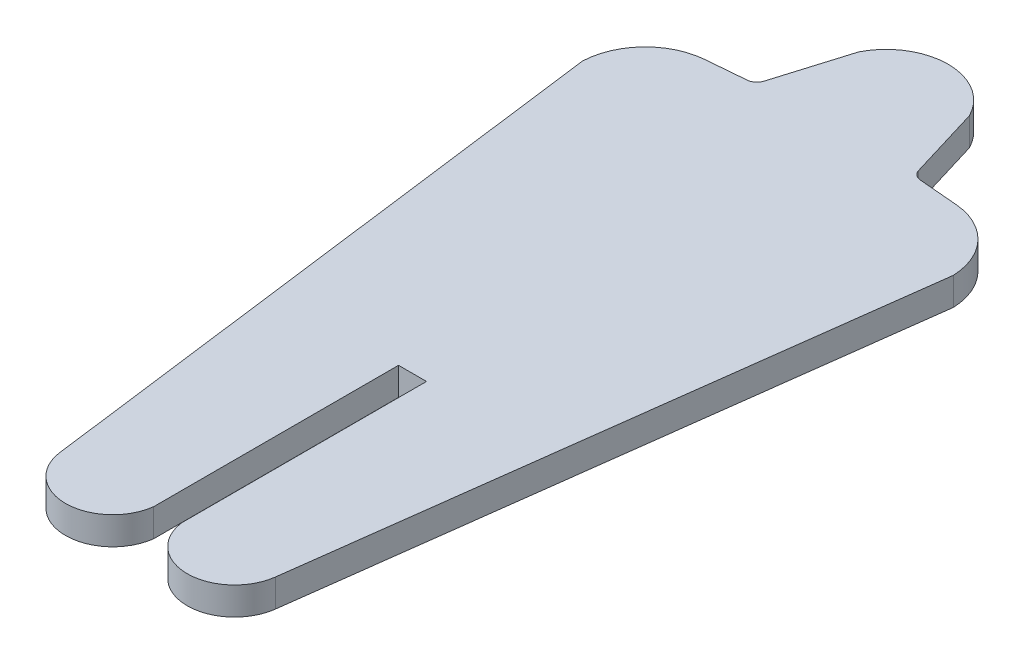
ISO-10303-21;
HEADER;
FILE_DESCRIPTION(('STEP AP214'),'2;1');
FILE_NAME('part.step','',(''),(''),'','','');
FILE_SCHEMA(('AUTOMOTIVE_DESIGN { 1 0 10303 214 1 1 1 1 }'));
ENDSEC;
DATA;
#1=APPLICATION_CONTEXT('core data for automotive mechanical design processes');
#2=APPLICATION_PROTOCOL_DEFINITION('international standard','automotive_design',2000,#1);
#3=PRODUCT_CONTEXT('',#1,'mechanical');
#4=PRODUCT('Part','Part','',(#3));
#5=PRODUCT_RELATED_PRODUCT_CATEGORY('part','',(#4));
#6=PRODUCT_DEFINITION_FORMATION('','',#4);
#7=PRODUCT_DEFINITION_CONTEXT('part definition',#1,'design');
#8=PRODUCT_DEFINITION('design','',#6,#7);
#9=PRODUCT_DEFINITION_SHAPE('','',#8);
#10=(LENGTH_UNIT() NAMED_UNIT(*) SI_UNIT(.MILLI.,.METRE.));
#11=(NAMED_UNIT(*) PLANE_ANGLE_UNIT() SI_UNIT($,.RADIAN.));
#12=(NAMED_UNIT(*) SI_UNIT($,.STERADIAN.) SOLID_ANGLE_UNIT());
#13=UNCERTAINTY_MEASURE_WITH_UNIT(LENGTH_MEASURE(1.E-05),#10,'distance_accuracy_value','');
#14=(GEOMETRIC_REPRESENTATION_CONTEXT(3) GLOBAL_UNCERTAINTY_ASSIGNED_CONTEXT((#13)) GLOBAL_UNIT_ASSIGNED_CONTEXT((#10,
#11,#12)) REPRESENTATION_CONTEXT('',''));
#15=CARTESIAN_POINT('',(0.,0.,0.));
#16=DIRECTION('',(0.,0.,1.));
#17=DIRECTION('',(1.,0.,0.));
#18=AXIS2_PLACEMENT_3D('',#15,#16,#17);
#19=CARTESIAN_POINT('',(136.033446322855,1.45,-243.035338057565));
#20=DIRECTION('',(-0.991724155452253,0.,-0.12838691324475));
#21=DIRECTION('',(-0.12838691324475,0.,0.991724155452253));
#22=AXIS2_PLACEMENT_3D('',#19,#20,#21);
#23=PLANE('',#22);
#24=DIRECTION('',(0.12838691324475,0.,-0.991724155452253));
#25=VECTOR('',#24,1.);
#26=CARTESIAN_POINT('',(136.033446322855,0.,-243.035338057565));
#27=LINE('',#26,#25);
#28=CARTESIAN_POINT('',(146.479849626352,0.,-323.728535143188));
#29=VERTEX_POINT('',#28);
#30=CARTESIAN_POINT('',(150.53009574584,0.,-355.01464375588));
#31=VERTEX_POINT('',#30);
#32=EDGE_CURVE('E180',#29,#31,#27,.T.);
#33=ORIENTED_EDGE('',*,*,#32,.T.);
#34=DIRECTION('',(0.,-1.,0.));
#35=VECTOR('',#34,1.);
#36=CARTESIAN_POINT('',(150.53009574584,1.45,-355.01464375588));
#37=LINE('',#36,#35);
#38=CARTESIAN_POINT('',(150.53009574584,1.45,-355.01464375588));
#39=VERTEX_POINT('',#38);
#40=EDGE_CURVE('E11',#39,#31,#37,.T.);
#41=ORIENTED_EDGE('',*,*,#40,.F.);
#42=DIRECTION('',(0.12838691324475,0.,-0.991724155452253));
#43=VECTOR('',#42,1.);
#44=CARTESIAN_POINT('',(136.033446322855,1.45,-243.035338057565));
#45=LINE('',#44,#43);
#46=CARTESIAN_POINT('',(146.479849626352,1.45,-323.728535143188));
#47=VERTEX_POINT('',#46);
#48=EDGE_CURVE('E219',#47,#39,#45,.T.);
#49=ORIENTED_EDGE('',*,*,#48,.F.);
#50=DIRECTION('',(0.,-1.,0.));
#51=VECTOR('',#50,1.);
#52=CARTESIAN_POINT('',(146.479849626352,1.45,-323.728535143188));
#53=LINE('',#52,#51);
#54=EDGE_CURVE('E176',#47,#29,#53,.T.);
#55=ORIENTED_EDGE('',*,*,#54,.T.);
#56=EDGE_LOOP('',(#33,#41,#49,#55));
#57=FACE_BOUND('',#56,.T.);
#58=ADVANCED_FACE('F37',(#57),#23,.F.);
#59=CARTESIAN_POINT('',(147.130452567162,1.45,-354.887927370378));
#60=DIRECTION('',(0.,-1.,0.));
#61=DIRECTION('',(0.,0.,-1.));
#62=AXIS2_PLACEMENT_3D('',#59,#60,#61);
#63=CYLINDRICAL_SURFACE('',#62,3.40200393660632);
#64=CARTESIAN_POINT('',(147.130452567162,0.,-354.887927370378));
#65=DIRECTION('',(0.,1.,0.));
#66=DIRECTION('',(0.,0.,1.));
#67=AXIS2_PLACEMENT_3D('',#64,#65,#66);
#68=CIRCLE('',#67,3.40200393660632);
#69=CARTESIAN_POINT('',(147.420197469524,0.,-358.277570224166));
#70=VERTEX_POINT('',#69);
#71=EDGE_CURVE('E183',#31,#70,#68,.T.);
#72=ORIENTED_EDGE('',*,*,#71,.T.);
#73=DIRECTION('',(0.,-1.,0.));
#74=VECTOR('',#73,1.);
#75=CARTESIAN_POINT('',(147.420197469524,1.45,-358.277570224166));
#76=LINE('',#75,#74);
#77=CARTESIAN_POINT('',(147.420197469524,1.45,-358.277570224166));
#78=VERTEX_POINT('',#77);
#79=EDGE_CURVE('E45',#78,#70,#76,.T.);
#80=ORIENTED_EDGE('',*,*,#79,.F.);
#81=CARTESIAN_POINT('',(147.130452567162,1.45,-354.887927370378));
#82=DIRECTION('',(0.,1.,0.));
#83=DIRECTION('',(0.,0.,1.));
#84=AXIS2_PLACEMENT_3D('',#81,#82,#83);
#85=CIRCLE('',#84,3.40200393660632);
#86=EDGE_CURVE('E116',#39,#78,#85,.T.);
#87=ORIENTED_EDGE('',*,*,#86,.F.);
#88=ORIENTED_EDGE('',*,*,#40,.T.);
#89=EDGE_LOOP('',(#72,#80,#87,#88));
#90=FACE_BOUND('',#89,.T.);
#91=ADVANCED_FACE('F251',(#90),#63,.T.);
#92=CARTESIAN_POINT('',(-39.1867338386929,1.45,-374.228633751436));
#93=DIRECTION('',(0.085168893166534,0.,-0.996366528761774));
#94=DIRECTION('',(-0.996366528761774,0.,-0.0851688931665341));
#95=AXIS2_PLACEMENT_3D('',#92,#93,#94);
#96=PLANE('',#95);
#97=DIRECTION('',(0.996366528761774,0.,0.0851688931665341));
#98=VECTOR('',#97,1.);
#99=CARTESIAN_POINT('',(-39.1867338386929,0.,-374.228633751436));
#100=LINE('',#99,#98);
#101=CARTESIAN_POINT('',(145.375119536964,0.,-358.452382423219));
#102=VERTEX_POINT('',#101);
#103=EDGE_CURVE('E186',#102,#70,#100,.T.);
#104=ORIENTED_EDGE('',*,*,#103,.F.);
#105=DIRECTION('',(0.,-1.,0.));
#106=VECTOR('',#105,1.);
#107=CARTESIAN_POINT('',(145.375119536964,1.45,-358.452382423219));
#108=LINE('',#107,#106);
#109=CARTESIAN_POINT('',(145.375119536964,1.45,-358.452382423219));
#110=VERTEX_POINT('',#109);
#111=EDGE_CURVE('E244',#110,#102,#108,.T.);
#112=ORIENTED_EDGE('',*,*,#111,.F.);
#113=DIRECTION('',(0.996366528761774,0.,0.0851688931665341));
#114=VECTOR('',#113,1.);
#115=CARTESIAN_POINT('',(-39.1867338386929,1.45,-374.228633751436));
#116=LINE('',#115,#114);
#117=EDGE_CURVE('E250',#110,#78,#116,.T.);
#118=ORIENTED_EDGE('',*,*,#117,.T.);
#119=ORIENTED_EDGE('',*,*,#79,.T.);
#120=EDGE_LOOP('',(#104,#112,#118,#119));
#121=FACE_BOUND('',#120,.T.);
#122=ADVANCED_FACE('F248',(#121),#96,.T.);
#123=CARTESIAN_POINT('',(145.422306578861,1.45,-359.004409972416));
#124=DIRECTION('',(0.,-1.,0.));
#125=DIRECTION('',(0.,0.,-1.));
#126=AXIS2_PLACEMENT_3D('',#123,#124,#125);
#127=CYLINDRICAL_SURFACE('',#126,0.554040641104413);
#128=CARTESIAN_POINT('',(145.422306578861,0.,-359.004409972416));
#129=DIRECTION('',(0.,1.,0.));
#130=DIRECTION('',(0.,0.,1.));
#131=AXIS2_PLACEMENT_3D('',#128,#129,#130);
#132=CIRCLE('',#131,0.554040641104413);
#133=CARTESIAN_POINT('',(144.8920428308,0.,-358.84384413082));
#134=VERTEX_POINT('',#133);
#135=EDGE_CURVE('E189',#134,#102,#132,.T.);
#136=ORIENTED_EDGE('',*,*,#135,.F.);
#137=DIRECTION('',(0.,-1.,0.));
#138=VECTOR('',#137,1.);
#139=CARTESIAN_POINT('',(144.8920428308,1.45,-358.84384413082));
#140=LINE('',#139,#138);
#141=CARTESIAN_POINT('',(144.8920428308,1.45,-358.84384413082));
#142=VERTEX_POINT('',#141);
#143=EDGE_CURVE('E242',#142,#134,#140,.T.);
#144=ORIENTED_EDGE('',*,*,#143,.F.);
#145=CARTESIAN_POINT('',(145.422306578861,1.45,-359.004409972416));
#146=DIRECTION('',(0.,1.,0.));
#147=DIRECTION('',(0.,0.,1.));
#148=AXIS2_PLACEMENT_3D('',#145,#146,#147);
#149=CIRCLE('',#148,0.554040641104413);
#150=EDGE_CURVE('E263',#142,#110,#149,.T.);
#151=ORIENTED_EDGE('',*,*,#150,.T.);
#152=ORIENTED_EDGE('',*,*,#111,.T.);
#153=EDGE_LOOP('',(#136,#144,#151,#152));
#154=FACE_BOUND('',#153,.T.);
#155=ADVANCED_FACE('F260',(#154),#127,.F.);
#156=CARTESIAN_POINT('',(154.161676438201,1.45,-328.23116962254));
#157=DIRECTION('',(0.957084555439553,0.,-0.289808822741948));
#158=DIRECTION('',(-0.289808822741948,0.,-0.957084555439553));
#159=AXIS2_PLACEMENT_3D('',#156,#157,#158);
#160=PLANE('',#159);
#161=DIRECTION('',(0.289808822741948,0.,0.957084555439553));
#162=VECTOR('',#161,1.);
#163=CARTESIAN_POINT('',(154.161676438201,0.,-328.23116962254));
#164=LINE('',#163,#162);
#165=CARTESIAN_POINT('',(143.74421014501,0.,-362.634525606298));
#166=VERTEX_POINT('',#165);
#167=EDGE_CURVE('E192',#166,#134,#164,.T.);
#168=ORIENTED_EDGE('',*,*,#167,.F.);
#169=DIRECTION('',(0.,-1.,0.));
#170=VECTOR('',#169,1.);
#171=CARTESIAN_POINT('',(143.74421014501,1.45,-362.634525606298));
#172=LINE('',#171,#170);
#173=CARTESIAN_POINT('',(143.74421014501,1.45,-362.634525606298));
#174=VERTEX_POINT('',#173);
#175=EDGE_CURVE('E240',#174,#166,#172,.T.);
#176=ORIENTED_EDGE('',*,*,#175,.F.);
#177=DIRECTION('',(0.289808822741948,0.,0.957084555439553));
#178=VECTOR('',#177,1.);
#179=CARTESIAN_POINT('',(154.161676438201,1.45,-328.23116962254));
#180=LINE('',#179,#178);
#181=EDGE_CURVE('E267',#174,#142,#180,.T.);
#182=ORIENTED_EDGE('',*,*,#181,.T.);
#183=ORIENTED_EDGE('',*,*,#143,.T.);
#184=EDGE_LOOP('',(#168,#176,#182,#183));
#185=FACE_BOUND('',#184,.T.);
#186=ADVANCED_FACE('F322',(#185),#160,.T.);
#187=CARTESIAN_POINT('',(140.86229529581,1.45,-361.17850699736));
#188=DIRECTION('',(0.,-1.,0.));
#189=DIRECTION('',(0.,0.,-1.));
#190=AXIS2_PLACEMENT_3D('',#187,#188,#189);
#191=CYLINDRICAL_SURFACE('',#190,3.22884242223351);
#192=CARTESIAN_POINT('',(140.86229529581,0.,-361.17850699736));
#193=DIRECTION('',(0.,1.,0.));
#194=DIRECTION('',(0.,0.,1.));
#195=AXIS2_PLACEMENT_3D('',#192,#193,#194);
#196=CIRCLE('',#195,3.22884242223351);
#197=CARTESIAN_POINT('',(137.980380294136,0.,-362.634525304504));
#198=VERTEX_POINT('',#197);
#199=EDGE_CURVE('E195',#166,#198,#196,.T.);
#200=ORIENTED_EDGE('',*,*,#199,.T.);
#201=DIRECTION('',(0.,-1.,0.));
#202=VECTOR('',#201,1.);
#203=CARTESIAN_POINT('',(137.980380294136,1.45,-362.634525304504));
#204=LINE('',#203,#202);
#205=CARTESIAN_POINT('',(137.980380294136,1.45,-362.634525304504));
#206=VERTEX_POINT('',#205);
#207=EDGE_CURVE('E238',#206,#198,#204,.T.);
#208=ORIENTED_EDGE('',*,*,#207,.F.);
#209=CARTESIAN_POINT('',(140.86229529581,1.45,-361.17850699736));
#210=DIRECTION('',(0.,1.,0.));
#211=DIRECTION('',(0.,0.,1.));
#212=AXIS2_PLACEMENT_3D('',#209,#210,#211);
#213=CIRCLE('',#212,3.22884242223351);
#214=EDGE_CURVE('E273',#174,#206,#213,.T.);
#215=ORIENTED_EDGE('',*,*,#214,.F.);
#216=ORIENTED_EDGE('',*,*,#175,.T.);
#217=EDGE_LOOP('',(#200,#208,#215,#216));
#218=FACE_BOUND('',#217,.T.);
#219=ADVANCED_FACE('F325',(#218),#191,.T.);
#220=CARTESIAN_POINT('',(95.7775692530297,1.45,-223.261091696266));
#221=DIRECTION('',(-0.957084539661645,0.,-0.289808874847989));
#222=DIRECTION('',(-0.289808874847989,0.,0.957084539661645));
#223=AXIS2_PLACEMENT_3D('',#220,#221,#222);
#224=PLANE('',#223);
#225=DIRECTION('',(0.289808874847989,0.,-0.957084539661645));
#226=VECTOR('',#225,1.);
#227=CARTESIAN_POINT('',(95.7775692530297,0.,-223.261091696266));
#228=LINE('',#227,#226);
#229=CARTESIAN_POINT('',(136.83254745993,0.,-358.843844082921));
#230=VERTEX_POINT('',#229);
#231=EDGE_CURVE('E198',#230,#198,#228,.T.);
#232=ORIENTED_EDGE('',*,*,#231,.F.);
#233=DIRECTION('',(0.,-1.,0.));
#234=VECTOR('',#233,1.);
#235=CARTESIAN_POINT('',(136.83254745993,1.45,-358.843844082921));
#236=LINE('',#235,#234);
#237=CARTESIAN_POINT('',(136.83254745993,1.45,-358.843844082921));
#238=VERTEX_POINT('',#237);
#239=EDGE_CURVE('E236',#238,#230,#236,.T.);
#240=ORIENTED_EDGE('',*,*,#239,.F.);
#241=DIRECTION('',(0.289808874847989,0.,-0.957084539661645));
#242=VECTOR('',#241,1.);
#243=CARTESIAN_POINT('',(95.7775692530297,1.45,-223.261091696266));
#244=LINE('',#243,#242);
#245=EDGE_CURVE('E275',#238,#206,#244,.T.);
#246=ORIENTED_EDGE('',*,*,#245,.T.);
#247=ORIENTED_EDGE('',*,*,#207,.T.);
#248=EDGE_LOOP('',(#232,#240,#246,#247));
#249=FACE_BOUND('',#248,.T.);
#250=ADVANCED_FACE('F329',(#249),#224,.T.);
#251=CARTESIAN_POINT('',(136.302283701965,1.45,-359.00440989181));
#252=DIRECTION('',(0.,-1.,0.));
#253=DIRECTION('',(0.,0.,-1.));
#254=AXIS2_PLACEMENT_3D('',#251,#252,#253);
#255=CYLINDRICAL_SURFACE('',#254,0.554040641104498);
#256=CARTESIAN_POINT('',(136.302283701965,0.,-359.00440989181));
#257=DIRECTION('',(0.,1.,0.));
#258=DIRECTION('',(0.,0.,1.));
#259=AXIS2_PLACEMENT_3D('',#256,#257,#258);
#260=CIRCLE('',#259,0.554040641104498);
#261=CARTESIAN_POINT('',(136.34947073482,0.,-358.45238234184));
#262=VERTEX_POINT('',#261);
#263=EDGE_CURVE('E201',#262,#230,#260,.T.);
#264=ORIENTED_EDGE('',*,*,#263,.F.);
#265=DIRECTION('',(0.,-1.,0.));
#266=VECTOR('',#265,1.);
#267=CARTESIAN_POINT('',(136.34947073482,1.45,-358.45238234184));
#268=LINE('',#267,#266);
#269=CARTESIAN_POINT('',(136.34947073482,1.45,-358.45238234184));
#270=VERTEX_POINT('',#269);
#271=EDGE_CURVE('E234',#270,#262,#268,.T.);
#272=ORIENTED_EDGE('',*,*,#271,.F.);
#273=CARTESIAN_POINT('',(136.302283701965,1.45,-359.00440989181));
#274=DIRECTION('',(0.,1.,0.));
#275=DIRECTION('',(0.,0.,1.));
#276=AXIS2_PLACEMENT_3D('',#273,#274,#275);
#277=CIRCLE('',#276,0.554040641104498);
#278=EDGE_CURVE('E278',#270,#238,#277,.T.);
#279=ORIENTED_EDGE('',*,*,#278,.T.);
#280=ORIENTED_EDGE('',*,*,#239,.T.);
#281=EDGE_LOOP('',(#264,#272,#279,#280));
#282=FACE_BOUND('',#281,.T.);
#283=ADVANCED_FACE('F333',(#282),#255,.F.);
#284=CARTESIAN_POINT('',(-54.789236048358,1.45,-342.113951993831));
#285=DIRECTION('',(-0.0851688569822913,0.,-0.996366531854784));
#286=DIRECTION('',(-0.996366531854784,0.,0.0851688569822913));
#287=AXIS2_PLACEMENT_3D('',#284,#285,#286);
#288=PLANE('',#287);
#289=DIRECTION('',(0.996366531854784,0.,-0.0851688569822913));
#290=VECTOR('',#289,1.);
#291=CARTESIAN_POINT('',(-54.789236048358,0.,-342.113951993831));
#292=LINE('',#291,#290);
#293=CARTESIAN_POINT('',(134.304392642444,0.,-358.277570203938));
#294=VERTEX_POINT('',#293);
#295=EDGE_CURVE('E204',#294,#262,#292,.T.);
#296=ORIENTED_EDGE('',*,*,#295,.F.);
#297=DIRECTION('',(0.,-1.,0.));
#298=VECTOR('',#297,1.);
#299=CARTESIAN_POINT('',(134.304392642444,1.45,-358.277570203938));
#300=LINE('',#299,#298);
#301=CARTESIAN_POINT('',(134.304392642444,1.45,-358.277570203938));
#302=VERTEX_POINT('',#301);
#303=EDGE_CURVE('E232',#302,#294,#300,.T.);
#304=ORIENTED_EDGE('',*,*,#303,.F.);
#305=DIRECTION('',(0.996366531854784,0.,-0.0851688569822913));
#306=VECTOR('',#305,1.);
#307=CARTESIAN_POINT('',(-54.789236048358,1.45,-342.113951993831));
#308=LINE('',#307,#306);
#309=EDGE_CURVE('E281',#302,#270,#308,.T.);
#310=ORIENTED_EDGE('',*,*,#309,.T.);
#311=ORIENTED_EDGE('',*,*,#271,.T.);
#312=EDGE_LOOP('',(#296,#304,#310,#311));
#313=FACE_BOUND('',#312,.T.);
#314=ADVANCED_FACE('F337',(#313),#288,.T.);
#315=CARTESIAN_POINT('',(134.59413779165,1.45,-354.88792737125));
#316=DIRECTION('',(0.,-1.,0.));
#317=DIRECTION('',(0.,0.,-1.));
#318=AXIS2_PLACEMENT_3D('',#315,#316,#317);
#319=CYLINDRICAL_SURFACE('',#318,3.40200393660621);
#320=CARTESIAN_POINT('',(134.59413779165,0.,-354.88792737125));
#321=DIRECTION('',(0.,1.,0.));
#322=DIRECTION('',(0.,0.,1.));
#323=AXIS2_PLACEMENT_3D('',#320,#321,#322);
#324=CIRCLE('',#323,3.40200393660621);
#325=CARTESIAN_POINT('',(131.194494600945,0.,-355.01464343408));
#326=VERTEX_POINT('',#325);
#327=EDGE_CURVE('E207',#294,#326,#324,.T.);
#328=ORIENTED_EDGE('',*,*,#327,.T.);
#329=DIRECTION('',(0.,-1.,0.));
#330=VECTOR('',#329,1.);
#331=CARTESIAN_POINT('',(131.194494600945,1.45,-355.01464343408));
#332=LINE('',#331,#330);
#333=CARTESIAN_POINT('',(131.194494600945,1.45,-355.01464343408));
#334=VERTEX_POINT('',#333);
#335=EDGE_CURVE('E229',#334,#326,#332,.T.);
#336=ORIENTED_EDGE('',*,*,#335,.F.);
#337=CARTESIAN_POINT('',(134.59413779165,1.45,-354.88792737125));
#338=DIRECTION('',(0.,1.,0.));
#339=DIRECTION('',(0.,0.,1.));
#340=AXIS2_PLACEMENT_3D('',#337,#338,#339);
#341=CIRCLE('',#340,3.40200393660621);
#342=EDGE_CURVE('E284',#302,#334,#341,.T.);
#343=ORIENTED_EDGE('',*,*,#342,.F.);
#344=ORIENTED_EDGE('',*,*,#303,.T.);
#345=EDGE_LOOP('',(#328,#336,#343,#344));
#346=FACE_BOUND('',#345,.T.);
#347=ADVANCED_FACE('F341',(#346),#319,.T.);
#348=CARTESIAN_POINT('',(139.453147854979,1.45,-291.22071207454));
#349=DIRECTION('',(0.991724155467161,0.,-0.128386913129592));
#350=DIRECTION('',(-0.128386913129592,0.,-0.991724155467161));
#351=AXIS2_PLACEMENT_3D('',#348,#349,#350);
#352=PLANE('',#351);
#353=DIRECTION('',(0.128386913129592,0.,0.991724155467162));
#354=VECTOR('',#353,1.);
#355=CARTESIAN_POINT('',(139.453147854979,0.,-291.22071207454));
#356=LINE('',#355,#354);
#357=CARTESIAN_POINT('',(135.24474066949,0.,-323.72853518637));
#358=VERTEX_POINT('',#357);
#359=EDGE_CURVE('E209',#326,#358,#356,.T.);
#360=ORIENTED_EDGE('',*,*,#359,.T.);
#361=DIRECTION('',(0.,-1.,0.));
#362=VECTOR('',#361,1.);
#363=CARTESIAN_POINT('',(135.24474066949,1.45,-323.72853518637));
#364=LINE('',#363,#362);
#365=CARTESIAN_POINT('',(135.24474066949,1.45,-323.72853518637));
#366=VERTEX_POINT('',#365);
#367=EDGE_CURVE('E226',#366,#358,#364,.T.);
#368=ORIENTED_EDGE('',*,*,#367,.F.);
#369=DIRECTION('',(0.128386913129592,0.,0.991724155467162));
#370=VECTOR('',#369,1.);
#371=CARTESIAN_POINT('',(139.453147854979,1.45,-291.22071207454));
#372=LINE('',#371,#370);
#373=EDGE_CURVE('E286',#334,#366,#372,.T.);
#374=ORIENTED_EDGE('',*,*,#373,.F.);
#375=ORIENTED_EDGE('',*,*,#335,.T.);
#376=EDGE_LOOP('',(#360,#368,#374,#375));
#377=FACE_BOUND('',#376,.T.);
#378=ADVANCED_FACE('F345',(#377),#352,.F.);
#379=CARTESIAN_POINT('',(137.689017537281,1.45,-324.044966811316));
#380=DIRECTION('',(0.,-1.,0.));
#381=DIRECTION('',(0.,0.,-1.));
#382=AXIS2_PLACEMENT_3D('',#379,#380,#381);
#383=CYLINDRICAL_SURFACE('',#382,2.4646740919812);
#384=CARTESIAN_POINT('',(137.689017537281,0.,-324.044966811316));
#385=DIRECTION('',(0.,1.,0.));
#386=DIRECTION('',(0.,0.,1.));
#387=AXIS2_PLACEMENT_3D('',#384,#385,#386);
#388=CIRCLE('',#387,2.4646740919812);
#389=CARTESIAN_POINT('',(140.133294399482,0.,-323.728535143188));
#390=VERTEX_POINT('',#389);
#391=EDGE_CURVE('E211',#358,#390,#388,.T.);
#392=ORIENTED_EDGE('',*,*,#391,.T.);
#393=DIRECTION('',(0.,-1.,0.));
#394=VECTOR('',#393,1.);
#395=CARTESIAN_POINT('',(140.133294399482,1.45,-323.728535143188));
#396=LINE('',#395,#394);
#397=CARTESIAN_POINT('',(140.133294399482,1.45,-323.728535143188));
#398=VERTEX_POINT('',#397);
#399=EDGE_CURVE('E223',#398,#390,#396,.T.);
#400=ORIENTED_EDGE('',*,*,#399,.F.);
#401=CARTESIAN_POINT('',(137.689017537281,1.45,-324.044966811316));
#402=DIRECTION('',(0.,1.,0.));
#403=DIRECTION('',(0.,0.,1.));
#404=AXIS2_PLACEMENT_3D('',#401,#402,#403);
#405=CIRCLE('',#404,2.4646740919812);
#406=EDGE_CURVE('E288',#366,#398,#405,.T.);
#407=ORIENTED_EDGE('',*,*,#406,.F.);
#408=ORIENTED_EDGE('',*,*,#367,.T.);
#409=EDGE_LOOP('',(#392,#400,#407,#408));
#410=FACE_BOUND('',#409,.T.);
#411=ADVANCED_FACE('F294',(#410),#383,.T.);
#412=CARTESIAN_POINT('',(140.133294399482,1.45,-266.906670720934));
#413=DIRECTION('',(-1.,0.,0.));
#414=DIRECTION('',(0.,0.,1.));
#415=AXIS2_PLACEMENT_3D('',#412,#413,#414);
#416=PLANE('',#415);
#417=DIRECTION('',(0.,0.,-1.));
#418=VECTOR('',#417,1.);
#419=CARTESIAN_POINT('',(140.133294399482,0.,-266.906670720934));
#420=LINE('',#419,#418);
#421=CARTESIAN_POINT('',(140.133294399482,0.,-336.49392048475));
#422=VERTEX_POINT('',#421);
#423=EDGE_CURVE('E213',#390,#422,#420,.T.);
#424=ORIENTED_EDGE('',*,*,#423,.T.);
#425=DIRECTION('',(0.,-1.,0.));
#426=VECTOR('',#425,1.);
#427=CARTESIAN_POINT('',(140.133294399482,1.45,-336.49392048475));
#428=LINE('',#427,#426);
#429=CARTESIAN_POINT('',(140.133294399482,1.45,-336.49392048475));
#430=VERTEX_POINT('',#429);
#431=EDGE_CURVE('E172',#430,#422,#428,.T.);
#432=ORIENTED_EDGE('',*,*,#431,.F.);
#433=DIRECTION('',(0.,0.,-1.));
#434=VECTOR('',#433,1.);
#435=CARTESIAN_POINT('',(140.133294399482,1.45,-266.906670720934));
#436=LINE('',#435,#434);
#437=EDGE_CURVE('E159',#398,#430,#436,.T.);
#438=ORIENTED_EDGE('',*,*,#437,.F.);
#439=ORIENTED_EDGE('',*,*,#399,.T.);
#440=EDGE_LOOP('',(#424,#432,#438,#439));
#441=FACE_BOUND('',#440,.T.);
#442=ADVANCED_FACE('F298',(#441),#416,.F.);
#443=CARTESIAN_POINT('',(-48.360559474051,1.45,-336.49392048475));
#444=DIRECTION('',(0.,0.,-1.));
#445=DIRECTION('',(-1.,0.,0.));
#446=AXIS2_PLACEMENT_3D('',#443,#444,#445);
#447=PLANE('',#446);
#448=DIRECTION('',(1.,0.,0.));
#449=VECTOR('',#448,1.);
#450=CARTESIAN_POINT('',(-48.360559474051,0.,-336.49392048475));
#451=LINE('',#450,#449);
#452=CARTESIAN_POINT('',(141.591295927037,0.,-336.49392048475));
#453=VERTEX_POINT('',#452);
#454=EDGE_CURVE('E168',#422,#453,#451,.T.);
#455=ORIENTED_EDGE('',*,*,#454,.T.);
#456=DIRECTION('',(0.,-1.,0.));
#457=VECTOR('',#456,1.);
#458=CARTESIAN_POINT('',(141.591295927037,1.45,-336.49392048475));
#459=LINE('',#458,#457);
#460=CARTESIAN_POINT('',(141.591295927037,1.45,-336.49392048475));
#461=VERTEX_POINT('',#460);
#462=EDGE_CURVE('E165',#461,#453,#459,.T.);
#463=ORIENTED_EDGE('',*,*,#462,.F.);
#464=DIRECTION('',(1.,0.,0.));
#465=VECTOR('',#464,1.);
#466=CARTESIAN_POINT('',(-48.360559474051,1.45,-336.49392048475));
#467=LINE('',#466,#465);
#468=EDGE_CURVE('E153',#430,#461,#467,.T.);
#469=ORIENTED_EDGE('',*,*,#468,.F.);
#470=ORIENTED_EDGE('',*,*,#431,.T.);
#471=EDGE_LOOP('',(#455,#463,#469,#470));
#472=FACE_BOUND('',#471,.T.);
#473=ADVANCED_FACE('F166',(#472),#447,.F.);
#474=CARTESIAN_POINT('',(141.591295927037,1.45,-266.906670720933));
#475=DIRECTION('',(-1.,0.,0.));
#476=DIRECTION('',(0.,0.,1.));
#477=AXIS2_PLACEMENT_3D('',#474,#475,#476);
#478=PLANE('',#477);
#479=DIRECTION('',(0.,0.,-1.));
#480=VECTOR('',#479,1.);
#481=CARTESIAN_POINT('',(141.591295927037,0.,-266.906670720933));
#482=LINE('',#481,#480);
#483=CARTESIAN_POINT('',(141.591295927037,0.,-323.728535313831));
#484=VERTEX_POINT('',#483);
#485=EDGE_CURVE('E216',#484,#453,#482,.T.);
#486=ORIENTED_EDGE('',*,*,#485,.F.);
#487=DIRECTION('',(0.,-1.,0.));
#488=VECTOR('',#487,1.);
#489=CARTESIAN_POINT('',(141.591295927037,1.45,-323.728535313831));
#490=LINE('',#489,#488);
#491=CARTESIAN_POINT('',(141.591295927037,1.45,-323.728535313831));
#492=VERTEX_POINT('',#491);
#493=EDGE_CURVE('E105',#492,#484,#490,.T.);
#494=ORIENTED_EDGE('',*,*,#493,.F.);
#495=DIRECTION('',(0.,0.,-1.));
#496=VECTOR('',#495,1.);
#497=CARTESIAN_POINT('',(141.591295927037,1.45,-266.906670720933));
#498=LINE('',#497,#496);
#499=EDGE_CURVE('E157',#492,#461,#498,.T.);
#500=ORIENTED_EDGE('',*,*,#499,.T.);
#501=ORIENTED_EDGE('',*,*,#462,.T.);
#502=EDGE_LOOP('',(#486,#494,#500,#501));
#503=FACE_BOUND('',#502,.T.);
#504=ADVANCED_FACE('F174',(#503),#478,.T.);
#505=CARTESIAN_POINT('',(144.03557278774,1.45,-324.04496699353));
#506=DIRECTION('',(0.,-1.,0.));
#507=DIRECTION('',(0.,0.,-1.));
#508=AXIS2_PLACEMENT_3D('',#505,#506,#507);
#509=CYLINDRICAL_SURFACE('',#508,2.46467409198121);
#510=CARTESIAN_POINT('',(144.03557278774,0.,-324.04496699353));
#511=DIRECTION('',(0.,1.,0.));
#512=DIRECTION('',(0.,0.,1.));
#513=AXIS2_PLACEMENT_3D('',#510,#511,#512);
#514=CIRCLE('',#513,2.46467409198121);
#515=EDGE_CURVE('E108',#484,#29,#514,.T.);
#516=ORIENTED_EDGE('',*,*,#515,.T.);
#517=ORIENTED_EDGE('',*,*,#54,.F.);
#518=CARTESIAN_POINT('',(144.03557278774,1.45,-324.04496699353));
#519=DIRECTION('',(0.,1.,0.));
#520=DIRECTION('',(0.,0.,1.));
#521=AXIS2_PLACEMENT_3D('',#518,#519,#520);
#522=CIRCLE('',#521,2.46467409198121);
#523=EDGE_CURVE('E53',#492,#47,#522,.T.);
#524=ORIENTED_EDGE('',*,*,#523,.F.);
#525=ORIENTED_EDGE('',*,*,#493,.T.);
#526=EDGE_LOOP('',(#516,#517,#524,#525));
#527=FACE_BOUND('',#526,.T.);
#528=ADVANCED_FACE('F301',(#527),#509,.T.);
#529=CARTESIAN_POINT('',(-48.360559474051,1.45,-266.906670720934));
#530=DIRECTION('',(0.,1.,0.));
#531=DIRECTION('',(0.,0.,1.));
#532=AXIS2_PLACEMENT_3D('',#529,#530,#531);
#533=PLANE('',#532);
#534=ORIENTED_EDGE('',*,*,#48,.T.);
#535=ORIENTED_EDGE('',*,*,#86,.T.);
#536=ORIENTED_EDGE('',*,*,#117,.F.);
#537=ORIENTED_EDGE('',*,*,#150,.F.);
#538=ORIENTED_EDGE('',*,*,#181,.F.);
#539=ORIENTED_EDGE('',*,*,#214,.T.);
#540=ORIENTED_EDGE('',*,*,#245,.F.);
#541=ORIENTED_EDGE('',*,*,#278,.F.);
#542=ORIENTED_EDGE('',*,*,#309,.F.);
#543=ORIENTED_EDGE('',*,*,#342,.T.);
#544=ORIENTED_EDGE('',*,*,#373,.T.);
#545=ORIENTED_EDGE('',*,*,#406,.T.);
#546=ORIENTED_EDGE('',*,*,#437,.T.);
#547=ORIENTED_EDGE('',*,*,#468,.T.);
#548=ORIENTED_EDGE('',*,*,#499,.F.);
#549=ORIENTED_EDGE('',*,*,#523,.T.);
#550=EDGE_LOOP('',(#534,#535,#536,#537,#538,#539,#540,#541,#542,#543,#544,#545,#546,#547,#548,#549));
#551=FACE_BOUND('',#550,.T.);
#552=ADVANCED_FACE('F155',(#551),#533,.T.);
#553=CARTESIAN_POINT('',(-48.360559474051,0.,-266.906670720934));
#554=DIRECTION('',(0.,1.,0.));
#555=DIRECTION('',(0.,0.,1.));
#556=AXIS2_PLACEMENT_3D('',#553,#554,#555);
#557=PLANE('',#556);
#558=ORIENTED_EDGE('',*,*,#32,.F.);
#559=ORIENTED_EDGE('',*,*,#515,.F.);
#560=ORIENTED_EDGE('',*,*,#485,.T.);
#561=ORIENTED_EDGE('',*,*,#454,.F.);
#562=ORIENTED_EDGE('',*,*,#423,.F.);
#563=ORIENTED_EDGE('',*,*,#391,.F.);
#564=ORIENTED_EDGE('',*,*,#359,.F.);
#565=ORIENTED_EDGE('',*,*,#327,.F.);
#566=ORIENTED_EDGE('',*,*,#295,.T.);
#567=ORIENTED_EDGE('',*,*,#263,.T.);
#568=ORIENTED_EDGE('',*,*,#231,.T.);
#569=ORIENTED_EDGE('',*,*,#199,.F.);
#570=ORIENTED_EDGE('',*,*,#167,.T.);
#571=ORIENTED_EDGE('',*,*,#135,.T.);
#572=ORIENTED_EDGE('',*,*,#103,.T.);
#573=ORIENTED_EDGE('',*,*,#71,.F.);
#574=EDGE_LOOP('',(#558,#559,#560,#561,#562,#563,#564,#565,#566,#567,#568,#569,#570,#571,#572,#573));
#575=FACE_BOUND('',#574,.T.);
#576=ADVANCED_FACE('F255',(#575),#557,.F.);
#577=CLOSED_SHELL('',(#58,#91,#122,#155,#186,#219,#250,#283,#314,#347,#378,#411,#442,#473,#504,
#528,#552,#576));
#578=MANIFOLD_SOLID_BREP('B2',#577);
#579=ADVANCED_BREP_SHAPE_REPRESENTATION('',(#18,#578),#14);
#580=SHAPE_DEFINITION_REPRESENTATION(#9,#579);
ENDSEC;
END-ISO-10303-21;
